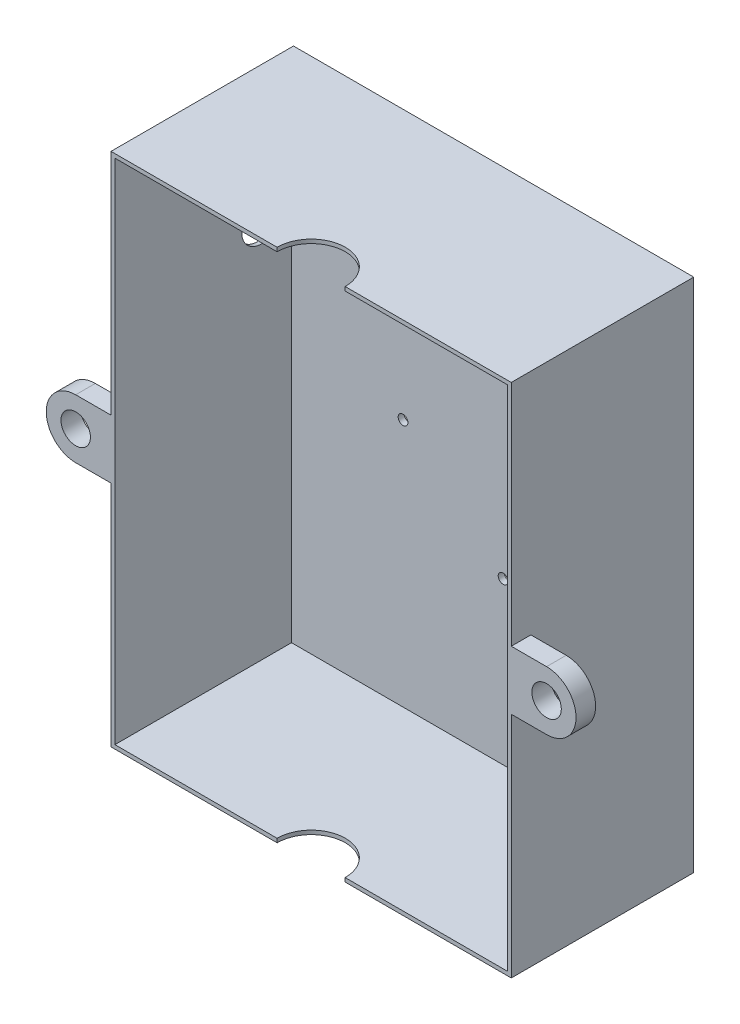
ISO-10303-21;
HEADER;
FILE_DESCRIPTION(('STEP AP214'),'2;1');
FILE_NAME('part.step','',(''),(''),'','','');
FILE_SCHEMA(('AUTOMOTIVE_DESIGN { 1 0 10303 214 1 1 1 1 }'));
ENDSEC;
DATA;
#1=APPLICATION_CONTEXT('core data for automotive mechanical design processes');
#2=APPLICATION_PROTOCOL_DEFINITION('international standard','automotive_design',2000,#1);
#3=PRODUCT_CONTEXT('',#1,'mechanical');
#4=PRODUCT('Part','Part','',(#3));
#5=PRODUCT_RELATED_PRODUCT_CATEGORY('part','',(#4));
#6=PRODUCT_DEFINITION_FORMATION('','',#4);
#7=PRODUCT_DEFINITION_CONTEXT('part definition',#1,'design');
#8=PRODUCT_DEFINITION('design','',#6,#7);
#9=PRODUCT_DEFINITION_SHAPE('','',#8);
#10=(LENGTH_UNIT() NAMED_UNIT(*) SI_UNIT(.MILLI.,.METRE.));
#11=(NAMED_UNIT(*) PLANE_ANGLE_UNIT() SI_UNIT($,.RADIAN.));
#12=(NAMED_UNIT(*) SI_UNIT($,.STERADIAN.) SOLID_ANGLE_UNIT());
#13=UNCERTAINTY_MEASURE_WITH_UNIT(LENGTH_MEASURE(1.E-05),#10,'distance_accuracy_value','');
#14=(GEOMETRIC_REPRESENTATION_CONTEXT(3) GLOBAL_UNCERTAINTY_ASSIGNED_CONTEXT((#13)) GLOBAL_UNIT_ASSIGNED_CONTEXT((#10,
#11,#12)) REPRESENTATION_CONTEXT('',''));
#15=CARTESIAN_POINT('',(0.,0.,0.));
#16=DIRECTION('',(0.,0.,1.));
#17=DIRECTION('',(1.,0.,0.));
#18=AXIS2_PLACEMENT_3D('',#15,#16,#17);
#19=CARTESIAN_POINT('',(0.,0.,93.));
#20=DIRECTION('',(0.,0.,1.));
#21=DIRECTION('',(1.,0.,0.));
#22=AXIS2_PLACEMENT_3D('',#19,#20,#21);
#23=PLANE('',#22);
#24=DIRECTION('',(0.,-1.,0.));
#25=VECTOR('',#24,1.);
#26=CARTESIAN_POINT('',(-15.6831277223151,124.735057131812,93.));
#27=LINE('',#26,#25);
#28=CARTESIAN_POINT('',(-15.6831277223151,124.735057131812,93.));
#29=VERTEX_POINT('',#28);
#30=CARTESIAN_POINT('',(-15.6831277223151,122.735057131812,93.));
#31=VERTEX_POINT('',#30);
#32=EDGE_CURVE('E13',#29,#31,#27,.T.);
#33=ORIENTED_EDGE('',*,*,#32,.F.);
#34=DIRECTION('',(-1.,0.,0.));
#35=VECTOR('',#34,1.);
#36=CARTESIAN_POINT('',(103.649083583159,124.735057131812,93.));
#37=LINE('',#36,#35);
#38=CARTESIAN_POINT('',(-100.350916416841,124.735057131812,93.));
#39=VERTEX_POINT('',#38);
#40=EDGE_CURVE('E306',#29,#39,#37,.T.);
#41=ORIENTED_EDGE('',*,*,#40,.T.);
#42=DIRECTION('',(0.,-1.,0.));
#43=VECTOR('',#42,1.);
#44=CARTESIAN_POINT('',(-100.350916416841,124.735057131812,93.));
#45=LINE('',#44,#43);
#46=CARTESIAN_POINT('',(-100.350916416841,8.29525975196561,93.));
#47=VERTEX_POINT('',#46);
#48=EDGE_CURVE('E295',#39,#47,#45,.T.);
#49=ORIENTED_EDGE('',*,*,#48,.T.);
#50=DIRECTION('',(-1.,0.,0.));
#51=VECTOR('',#50,1.);
#52=CARTESIAN_POINT('',(-118.350916416841,8.29525975196548,93.));
#53=LINE('',#52,#51);
#54=CARTESIAN_POINT('',(-118.350916416841,8.29525975196548,93.));
#55=VERTEX_POINT('',#54);
#56=EDGE_CURVE('E60',#47,#55,#53,.T.);
#57=ORIENTED_EDGE('',*,*,#56,.T.);
#58=CARTESIAN_POINT('',(-118.350916416841,-6.70474024803448,93.));
#59=DIRECTION('',(0.,0.,1.));
#60=DIRECTION('',(1.,0.,0.));
#61=AXIS2_PLACEMENT_3D('',#58,#59,#60);
#62=CIRCLE('',#61,15.);
#63=CARTESIAN_POINT('',(-118.350916416841,-21.7047402480344,93.));
#64=VERTEX_POINT('',#63);
#65=EDGE_CURVE('E199',#55,#64,#62,.T.);
#66=ORIENTED_EDGE('',*,*,#65,.T.);
#67=DIRECTION('',(1.,0.,0.));
#68=VECTOR('',#67,1.);
#69=CARTESIAN_POINT('',(-118.350916416841,-21.7047402480344,93.));
#70=LINE('',#69,#68);
#71=CARTESIAN_POINT('',(-100.350916416841,-21.7047402480343,93.));
#72=VERTEX_POINT('',#71);
#73=EDGE_CURVE('E372',#64,#72,#70,.T.);
#74=ORIENTED_EDGE('',*,*,#73,.T.);
#75=CARTESIAN_POINT('',(-100.350916416841,-138.14453762788,93.));
#76=VERTEX_POINT('',#75);
#77=EDGE_CURVE('E204',#72,#76,#45,.T.);
#78=ORIENTED_EDGE('',*,*,#77,.T.);
#79=DIRECTION('',(1.,0.,0.));
#80=VECTOR('',#79,1.);
#81=CARTESIAN_POINT('',(-100.350916416841,-138.14453762788,93.));
#82=LINE('',#81,#80);
#83=CARTESIAN_POINT('',(-15.6831277223151,-138.14453762788,93.));
#84=VERTEX_POINT('',#83);
#85=EDGE_CURVE('E299',#76,#84,#82,.T.);
#86=ORIENTED_EDGE('',*,*,#85,.T.);
#87=CARTESIAN_POINT('',(-15.6831277223151,-136.14453762788,93.));
#88=VERTEX_POINT('',#87);
#89=EDGE_CURVE('E49',#88,#84,#27,.T.);
#90=ORIENTED_EDGE('',*,*,#89,.F.);
#91=DIRECTION('',(1.,0.,0.));
#92=VECTOR('',#91,1.);
#93=CARTESIAN_POINT('',(-98.3509164168411,-136.14453762788,93.));
#94=LINE('',#93,#92);
#95=CARTESIAN_POINT('',(-98.3509164168411,-136.14453762788,93.));
#96=VERTEX_POINT('',#95);
#97=EDGE_CURVE('E289',#96,#88,#94,.T.);
#98=ORIENTED_EDGE('',*,*,#97,.F.);
#99=DIRECTION('',(0.,-1.,0.));
#100=VECTOR('',#99,1.);
#101=CARTESIAN_POINT('',(-98.3509164168411,122.735057131812,93.));
#102=LINE('',#101,#100);
#103=CARTESIAN_POINT('',(-98.3509164168411,122.735057131812,93.));
#104=VERTEX_POINT('',#103);
#105=EDGE_CURVE('E285',#104,#96,#102,.T.);
#106=ORIENTED_EDGE('',*,*,#105,.F.);
#107=DIRECTION('',(-1.,0.,0.));
#108=VECTOR('',#107,1.);
#109=CARTESIAN_POINT('',(101.649083583159,122.735057131812,93.));
#110=LINE('',#109,#108);
#111=EDGE_CURVE('E261',#31,#104,#110,.T.);
#112=ORIENTED_EDGE('',*,*,#111,.F.);
#113=EDGE_LOOP('',(#33,#41,#49,#57,#66,#74,#78,#86,#90,#98,#106,#112));
#114=FACE_BOUND('',#113,.T.);
#115=CARTESIAN_POINT('',(-118.350916416841,-6.70474024803448,93.));
#116=DIRECTION('',(0.,0.,1.));
#117=DIRECTION('',(1.,0.,0.));
#118=AXIS2_PLACEMENT_3D('',#115,#116,#117);
#119=CIRCLE('',#118,7.5);
#120=CARTESIAN_POINT('',(-110.850916416841,-6.70474024803448,93.));
#121=VERTEX_POINT('',#120);
#122=EDGE_CURVE('E422',#121,#121,#119,.T.);
#123=ORIENTED_EDGE('',*,*,#122,.F.);
#124=EDGE_LOOP('',(#123));
#125=FACE_BOUND('',#124,.T.);
#126=ADVANCED_FACE('F45',(#114,#125),#23,.T.);
#127=CARTESIAN_POINT('',(0.,0.,3.));
#128=DIRECTION('',(0.,0.,-1.));
#129=DIRECTION('',(-1.,0.,0.));
#130=AXIS2_PLACEMENT_3D('',#127,#128,#129);
#131=PLANE('',#130);
#132=CARTESIAN_POINT('',(-41.5144444892979,-9.33687059436405,3.));
#133=DIRECTION('',(0.,0.,-1.));
#134=DIRECTION('',(-1.,0.,0.));
#135=AXIS2_PLACEMENT_3D('',#132,#133,#134);
#136=CIRCLE('',#135,2.50000000000045);
#137=CARTESIAN_POINT('',(-44.0144444892983,-9.33687059436405,3.));
#138=VERTEX_POINT('',#137);
#139=EDGE_CURVE('E258',#138,#138,#136,.T.);
#140=ORIENTED_EDGE('',*,*,#139,.T.);
#141=EDGE_LOOP('',(#140));
#142=FACE_BOUND('',#141,.T.);
#143=CARTESIAN_POINT('',(9.48555551070217,35.263129405635,3.));
#144=DIRECTION('',(0.,0.,-1.));
#145=DIRECTION('',(-1.,0.,0.));
#146=AXIS2_PLACEMENT_3D('',#143,#144,#145);
#147=CIRCLE('',#146,2.50000000000605);
#148=CARTESIAN_POINT('',(6.98555551069612,35.263129405635,3.));
#149=VERTEX_POINT('',#148);
#150=EDGE_CURVE('E265',#149,#149,#147,.T.);
#151=ORIENTED_EDGE('',*,*,#150,.T.);
#152=EDGE_LOOP('',(#151));
#153=FACE_BOUND('',#152,.T.);
#154=CARTESIAN_POINT('',(9.48555551070217,-53.9368705943671,3.));
#155=DIRECTION('',(0.,0.,-1.));
#156=DIRECTION('',(-1.,0.,0.));
#157=AXIS2_PLACEMENT_3D('',#154,#155,#156);
#158=CIRCLE('',#157,2.5);
#159=CARTESIAN_POINT('',(6.98555551070217,-53.9368705943671,3.));
#160=VERTEX_POINT('',#159);
#161=EDGE_CURVE('E271',#160,#160,#158,.T.);
#162=ORIENTED_EDGE('',*,*,#161,.T.);
#163=EDGE_LOOP('',(#162));
#164=FACE_BOUND('',#163,.T.);
#165=CARTESIAN_POINT('',(46.9855555107033,-20.6368705943667,3.));
#166=DIRECTION('',(0.,0.,-1.));
#167=DIRECTION('',(-1.,0.,0.));
#168=AXIS2_PLACEMENT_3D('',#165,#166,#167);
#169=CIRCLE('',#168,2.49999999999833);
#170=CARTESIAN_POINT('',(44.485555510705,-20.6368705943667,3.));
#171=VERTEX_POINT('',#170);
#172=EDGE_CURVE('E277',#171,#171,#169,.T.);
#173=ORIENTED_EDGE('',*,*,#172,.T.);
#174=EDGE_LOOP('',(#173));
#175=FACE_BOUND('',#174,.T.);
#176=DIRECTION('',(0.,1.,0.));
#177=VECTOR('',#176,1.);
#178=CARTESIAN_POINT('',(101.649083583159,-136.14453762788,3.));
#179=LINE('',#178,#177);
#180=CARTESIAN_POINT('',(101.649083583159,-136.14453762788,3.));
#181=VERTEX_POINT('',#180);
#182=CARTESIAN_POINT('',(101.649083583159,122.735057131812,3.));
#183=VERTEX_POINT('',#182);
#184=EDGE_CURVE('E335',#181,#183,#179,.T.);
#185=ORIENTED_EDGE('',*,*,#184,.T.);
#186=DIRECTION('',(-1.,0.,0.));
#187=VECTOR('',#186,1.);
#188=CARTESIAN_POINT('',(-98.3509164168411,122.735057131812,3.));
#189=LINE('',#188,#187);
#190=CARTESIAN_POINT('',(-98.3509164168411,122.735057131812,3.));
#191=VERTEX_POINT('',#190);
#192=EDGE_CURVE('E345',#183,#191,#189,.T.);
#193=ORIENTED_EDGE('',*,*,#192,.T.);
#194=DIRECTION('',(0.,-1.,0.));
#195=VECTOR('',#194,1.);
#196=CARTESIAN_POINT('',(-98.3509164168411,-136.14453762788,3.));
#197=LINE('',#196,#195);
#198=CARTESIAN_POINT('',(-98.3509164168411,-136.14453762788,3.));
#199=VERTEX_POINT('',#198);
#200=EDGE_CURVE('E348',#191,#199,#197,.T.);
#201=ORIENTED_EDGE('',*,*,#200,.T.);
#202=DIRECTION('',(1.,0.,0.));
#203=VECTOR('',#202,1.);
#204=CARTESIAN_POINT('',(-98.3509164168411,-136.14453762788,3.));
#205=LINE('',#204,#203);
#206=EDGE_CURVE('E351',#199,#181,#205,.T.);
#207=ORIENTED_EDGE('',*,*,#206,.T.);
#208=EDGE_LOOP('',(#185,#193,#201,#207));
#209=FACE_BOUND('',#208,.T.);
#210=ADVANCED_FACE('F398',(#142,#153,#164,#175,#209),#131,.F.);
#211=CARTESIAN_POINT('',(101.649083583159,122.735057131812,0.));
#212=DIRECTION('',(0.,1.,0.));
#213=DIRECTION('',(-1.,0.,0.));
#214=AXIS2_PLACEMENT_3D('',#211,#212,#213);
#215=PLANE('',#214);
#216=CARTESIAN_POINT('',(101.649083583159,122.735057131812,93.));
#217=VERTEX_POINT('',#216);
#218=CARTESIAN_POINT('',(18.9812535175443,122.735057131812,93.));
#219=VERTEX_POINT('',#218);
#220=EDGE_CURVE('E282',#217,#219,#110,.T.);
#221=ORIENTED_EDGE('',*,*,#220,.T.);
#222=CARTESIAN_POINT('',(1.6490628976146,122.735057131812,92.9340912458591));
#223=DIRECTION('',(0.,1.,0.));
#224=DIRECTION('',(-1.,0.,0.));
#225=AXIS2_PLACEMENT_3D('',#222,#223,#224);
#226=CIRCLE('',#225,17.3323159343883);
#227=EDGE_CURVE('E250',#219,#31,#226,.T.);
#228=ORIENTED_EDGE('',*,*,#227,.T.);
#229=ORIENTED_EDGE('',*,*,#111,.T.);
#230=DIRECTION('',(0.,0.,1.));
#231=VECTOR('',#230,1.);
#232=CARTESIAN_POINT('',(-98.3509164168411,122.735057131812,0.));
#233=LINE('',#232,#231);
#234=EDGE_CURVE('E310',#191,#104,#233,.T.);
#235=ORIENTED_EDGE('',*,*,#234,.F.);
#236=ORIENTED_EDGE('',*,*,#192,.F.);
#237=DIRECTION('',(0.,0.,1.));
#238=VECTOR('',#237,1.);
#239=CARTESIAN_POINT('',(101.649083583159,122.735057131812,0.));
#240=LINE('',#239,#238);
#241=EDGE_CURVE('E311',#183,#217,#240,.T.);
#242=ORIENTED_EDGE('',*,*,#241,.T.);
#243=EDGE_LOOP('',(#221,#228,#229,#235,#236,#242));
#244=FACE_BOUND('',#243,.T.);
#245=ADVANCED_FACE('F406',(#244),#215,.F.);
#246=CARTESIAN_POINT('',(101.649083583159,-136.14453762788,0.));
#247=DIRECTION('',(1.,0.,0.));
#248=DIRECTION('',(0.,1.,0.));
#249=AXIS2_PLACEMENT_3D('',#246,#247,#248);
#250=PLANE('',#249);
#251=ORIENTED_EDGE('',*,*,#241,.F.);
#252=ORIENTED_EDGE('',*,*,#184,.F.);
#253=DIRECTION('',(0.,0.,1.));
#254=VECTOR('',#253,1.);
#255=CARTESIAN_POINT('',(101.649083583159,-136.14453762788,0.));
#256=LINE('',#255,#254);
#257=CARTESIAN_POINT('',(101.649083583159,-136.14453762788,93.));
#258=VERTEX_POINT('',#257);
#259=EDGE_CURVE('E314',#181,#258,#256,.T.);
#260=ORIENTED_EDGE('',*,*,#259,.T.);
#261=DIRECTION('',(0.,1.,0.));
#262=VECTOR('',#261,1.);
#263=CARTESIAN_POINT('',(101.649083583159,-136.14453762788,93.));
#264=LINE('',#263,#262);
#265=EDGE_CURVE('E292',#258,#217,#264,.T.);
#266=ORIENTED_EDGE('',*,*,#265,.T.);
#267=EDGE_LOOP('',(#251,#252,#260,#266));
#268=FACE_BOUND('',#267,.T.);
#269=ADVANCED_FACE('F396',(#268),#250,.F.);
#270=CARTESIAN_POINT('',(-98.3509164168411,-136.14453762788,0.));
#271=DIRECTION('',(0.,-1.,0.));
#272=DIRECTION('',(0.,0.,-1.));
#273=AXIS2_PLACEMENT_3D('',#270,#271,#272);
#274=PLANE('',#273);
#275=ORIENTED_EDGE('',*,*,#97,.T.);
#276=CARTESIAN_POINT('',(1.6490628976146,-136.14453762788,92.9340912458591));
#277=DIRECTION('',(0.,-1.,0.));
#278=DIRECTION('',(0.,0.,-1.));
#279=AXIS2_PLACEMENT_3D('',#276,#277,#278);
#280=CIRCLE('',#279,17.3323159343883);
#281=CARTESIAN_POINT('',(18.9812535175443,-136.14453762788,93.));
#282=VERTEX_POINT('',#281);
#283=EDGE_CURVE('E254',#88,#282,#280,.T.);
#284=ORIENTED_EDGE('',*,*,#283,.T.);
#285=EDGE_CURVE('E288',#282,#258,#94,.T.);
#286=ORIENTED_EDGE('',*,*,#285,.T.);
#287=ORIENTED_EDGE('',*,*,#259,.F.);
#288=ORIENTED_EDGE('',*,*,#206,.F.);
#289=DIRECTION('',(0.,0.,1.));
#290=VECTOR('',#289,1.);
#291=CARTESIAN_POINT('',(-98.3509164168411,-136.14453762788,0.));
#292=LINE('',#291,#290);
#293=EDGE_CURVE('E317',#199,#96,#292,.T.);
#294=ORIENTED_EDGE('',*,*,#293,.T.);
#295=EDGE_LOOP('',(#275,#284,#286,#287,#288,#294));
#296=FACE_BOUND('',#295,.T.);
#297=ADVANCED_FACE('F392',(#296),#274,.F.);
#298=CARTESIAN_POINT('',(-98.3509164168411,122.735057131812,0.));
#299=DIRECTION('',(-1.,0.,0.));
#300=DIRECTION('',(0.,0.,1.));
#301=AXIS2_PLACEMENT_3D('',#298,#299,#300);
#302=PLANE('',#301);
#303=CARTESIAN_POINT('',(-98.3509164168411,57.5422285629295,18.3648736332411));
#304=DIRECTION('',(-1.,0.,0.));
#305=DIRECTION('',(0.,0.,1.));
#306=AXIS2_PLACEMENT_3D('',#303,#304,#305);
#307=CIRCLE('',#306,10.0000000000014);
#308=CARTESIAN_POINT('',(-98.3509164168411,57.5422285629295,28.3648736332425));
#309=VERTEX_POINT('',#308);
#310=EDGE_CURVE('E425',#309,#309,#307,.F.);
#311=ORIENTED_EDGE('',*,*,#310,.F.);
#312=EDGE_LOOP('',(#311));
#313=FACE_BOUND('',#312,.T.);
#314=ORIENTED_EDGE('',*,*,#293,.F.);
#315=ORIENTED_EDGE('',*,*,#200,.F.);
#316=ORIENTED_EDGE('',*,*,#234,.T.);
#317=ORIENTED_EDGE('',*,*,#105,.T.);
#318=EDGE_LOOP('',(#314,#315,#316,#317));
#319=FACE_BOUND('',#318,.T.);
#320=ADVANCED_FACE('F401',(#313,#319),#302,.F.);
#321=CARTESIAN_POINT('',(103.649083583159,124.735057131812,0.));
#322=DIRECTION('',(0.,1.,0.));
#323=DIRECTION('',(-1.,0.,0.));
#324=AXIS2_PLACEMENT_3D('',#321,#322,#323);
#325=PLANE('',#324);
#326=CARTESIAN_POINT('',(1.6490628976146,124.735057131812,92.9340912458591));
#327=DIRECTION('',(0.,-1.,0.));
#328=DIRECTION('',(0.,0.,-1.));
#329=AXIS2_PLACEMENT_3D('',#326,#327,#328);
#330=CIRCLE('',#329,17.3323159343883);
#331=CARTESIAN_POINT('',(18.9812535175443,124.735057131812,93.));
#332=VERTEX_POINT('',#331);
#333=EDGE_CURVE('E247',#29,#332,#330,.T.);
#334=ORIENTED_EDGE('',*,*,#333,.T.);
#335=CARTESIAN_POINT('',(103.649083583159,124.735057131812,93.));
#336=VERTEX_POINT('',#335);
#337=EDGE_CURVE('E307',#336,#332,#37,.T.);
#338=ORIENTED_EDGE('',*,*,#337,.F.);
#339=DIRECTION('',(0.,0.,1.));
#340=VECTOR('',#339,1.);
#341=CARTESIAN_POINT('',(103.649083583159,124.735057131812,0.));
#342=LINE('',#341,#340);
#343=CARTESIAN_POINT('',(103.649083583159,124.735057131812,0.));
#344=VERTEX_POINT('',#343);
#345=EDGE_CURVE('E336',#344,#336,#342,.T.);
#346=ORIENTED_EDGE('',*,*,#345,.F.);
#347=DIRECTION('',(-1.,0.,0.));
#348=VECTOR('',#347,1.);
#349=CARTESIAN_POINT('',(103.649083583159,124.735057131812,0.));
#350=LINE('',#349,#348);
#351=CARTESIAN_POINT('',(-100.350916416841,124.735057131812,0.));
#352=VERTEX_POINT('',#351);
#353=EDGE_CURVE('E328',#344,#352,#350,.T.);
#354=ORIENTED_EDGE('',*,*,#353,.T.);
#355=DIRECTION('',(0.,0.,1.));
#356=VECTOR('',#355,1.);
#357=CARTESIAN_POINT('',(-100.350916416841,124.735057131812,0.));
#358=LINE('',#357,#356);
#359=EDGE_CURVE('E332',#352,#39,#358,.T.);
#360=ORIENTED_EDGE('',*,*,#359,.T.);
#361=ORIENTED_EDGE('',*,*,#40,.F.);
#362=EDGE_LOOP('',(#334,#338,#346,#354,#360,#361));
#363=FACE_BOUND('',#362,.T.);
#364=ADVANCED_FACE('F409',(#363),#325,.T.);
#365=CARTESIAN_POINT('',(103.649083583159,-138.14453762788,0.));
#366=DIRECTION('',(1.,0.,0.));
#367=DIRECTION('',(0.,0.,-1.));
#368=AXIS2_PLACEMENT_3D('',#365,#366,#367);
#369=PLANE('',#368);
#370=DIRECTION('',(0.,0.,1.));
#371=VECTOR('',#370,1.);
#372=CARTESIAN_POINT('',(103.649083583159,8.29525975196571,83.));
#373=LINE('',#372,#371);
#374=CARTESIAN_POINT('',(103.649083583159,8.29525975196571,83.));
#375=VERTEX_POINT('',#374);
#376=CARTESIAN_POINT('',(103.649083583159,8.29525975196571,93.));
#377=VERTEX_POINT('',#376);
#378=EDGE_CURVE('E239',#375,#377,#373,.T.);
#379=ORIENTED_EDGE('',*,*,#378,.F.);
#380=DIRECTION('',(0.,-1.,0.));
#381=VECTOR('',#380,1.);
#382=CARTESIAN_POINT('',(103.649083583159,-21.7047402480343,83.));
#383=LINE('',#382,#381);
#384=CARTESIAN_POINT('',(103.649083583159,-21.7047402480343,83.));
#385=VERTEX_POINT('',#384);
#386=EDGE_CURVE('E219',#375,#385,#383,.T.);
#387=ORIENTED_EDGE('',*,*,#386,.T.);
#388=DIRECTION('',(0.,0.,1.));
#389=VECTOR('',#388,1.);
#390=CARTESIAN_POINT('',(103.649083583159,-21.7047402480343,83.));
#391=LINE('',#390,#389);
#392=CARTESIAN_POINT('',(103.649083583159,-21.7047402480343,93.));
#393=VERTEX_POINT('',#392);
#394=EDGE_CURVE('E232',#385,#393,#391,.T.);
#395=ORIENTED_EDGE('',*,*,#394,.T.);
#396=DIRECTION('',(0.,1.,0.));
#397=VECTOR('',#396,1.);
#398=CARTESIAN_POINT('',(103.649083583159,-138.14453762788,93.));
#399=LINE('',#398,#397);
#400=CARTESIAN_POINT('',(103.649083583159,-138.14453762788,93.));
#401=VERTEX_POINT('',#400);
#402=EDGE_CURVE('E303',#401,#393,#399,.T.);
#403=ORIENTED_EDGE('',*,*,#402,.F.);
#404=DIRECTION('',(0.,0.,1.));
#405=VECTOR('',#404,1.);
#406=CARTESIAN_POINT('',(103.649083583159,-138.14453762788,0.));
#407=LINE('',#406,#405);
#408=CARTESIAN_POINT('',(103.649083583159,-138.14453762788,0.));
#409=VERTEX_POINT('',#408);
#410=EDGE_CURVE('E339',#409,#401,#407,.T.);
#411=ORIENTED_EDGE('',*,*,#410,.F.);
#412=DIRECTION('',(0.,1.,0.));
#413=VECTOR('',#412,1.);
#414=CARTESIAN_POINT('',(103.649083583159,-138.14453762788,0.));
#415=LINE('',#414,#413);
#416=EDGE_CURVE('E325',#409,#344,#415,.T.);
#417=ORIENTED_EDGE('',*,*,#416,.T.);
#418=ORIENTED_EDGE('',*,*,#345,.T.);
#419=EDGE_CURVE('E302',#377,#336,#399,.T.);
#420=ORIENTED_EDGE('',*,*,#419,.F.);
#421=EDGE_LOOP('',(#379,#387,#395,#403,#411,#417,#418,#420));
#422=FACE_BOUND('',#421,.T.);
#423=ADVANCED_FACE('F380',(#422),#369,.T.);
#424=CARTESIAN_POINT('',(-100.350916416841,-138.14453762788,0.));
#425=DIRECTION('',(0.,-1.,0.));
#426=DIRECTION('',(0.,0.,-1.));
#427=AXIS2_PLACEMENT_3D('',#424,#425,#426);
#428=PLANE('',#427);
#429=CARTESIAN_POINT('',(1.6490628976146,-138.14453762788,92.9340912458591));
#430=DIRECTION('',(0.,-1.,0.));
#431=DIRECTION('',(0.,0.,-1.));
#432=AXIS2_PLACEMENT_3D('',#429,#430,#431);
#433=CIRCLE('',#432,17.3323159343883);
#434=CARTESIAN_POINT('',(18.9812535175442,-138.14453762788,93.));
#435=VERTEX_POINT('',#434);
#436=EDGE_CURVE('E241',#84,#435,#433,.T.);
#437=ORIENTED_EDGE('',*,*,#436,.F.);
#438=ORIENTED_EDGE('',*,*,#85,.F.);
#439=DIRECTION('',(0.,0.,1.));
#440=VECTOR('',#439,1.);
#441=CARTESIAN_POINT('',(-100.350916416841,-138.14453762788,0.));
#442=LINE('',#441,#440);
#443=CARTESIAN_POINT('',(-100.350916416841,-138.14453762788,0.));
#444=VERTEX_POINT('',#443);
#445=EDGE_CURVE('E331',#444,#76,#442,.T.);
#446=ORIENTED_EDGE('',*,*,#445,.F.);
#447=DIRECTION('',(1.,0.,0.));
#448=VECTOR('',#447,1.);
#449=CARTESIAN_POINT('',(-100.350916416841,-138.14453762788,0.));
#450=LINE('',#449,#448);
#451=EDGE_CURVE('E322',#444,#409,#450,.T.);
#452=ORIENTED_EDGE('',*,*,#451,.T.);
#453=ORIENTED_EDGE('',*,*,#410,.T.);
#454=EDGE_CURVE('E298',#435,#401,#82,.T.);
#455=ORIENTED_EDGE('',*,*,#454,.F.);
#456=EDGE_LOOP('',(#437,#438,#446,#452,#453,#455));
#457=FACE_BOUND('',#456,.T.);
#458=ADVANCED_FACE('F367',(#457),#428,.T.);
#459=CARTESIAN_POINT('',(-100.350916416841,122.735057131812,0.));
#460=DIRECTION('',(-1.,0.,0.));
#461=DIRECTION('',(0.,-1.,0.));
#462=AXIS2_PLACEMENT_3D('',#459,#460,#461);
#463=PLANE('',#462);
#464=CARTESIAN_POINT('',(-100.350916416841,57.5422285629295,18.3648736332411));
#465=DIRECTION('',(-1.,0.,0.));
#466=DIRECTION('',(0.,0.,1.));
#467=AXIS2_PLACEMENT_3D('',#464,#465,#466);
#468=CIRCLE('',#467,10.0000000000014);
#469=CARTESIAN_POINT('',(-100.350916416841,57.5422285629295,28.3648736332425));
#470=VERTEX_POINT('',#469);
#471=EDGE_CURVE('E428',#470,#470,#468,.T.);
#472=ORIENTED_EDGE('',*,*,#471,.F.);
#473=EDGE_LOOP('',(#472));
#474=FACE_BOUND('',#473,.T.);
#475=DIRECTION('',(0.,0.,1.));
#476=VECTOR('',#475,1.);
#477=CARTESIAN_POINT('',(-100.350916416841,-21.7047402480343,83.));
#478=LINE('',#477,#476);
#479=CARTESIAN_POINT('',(-100.350916416841,-21.7047402480343,83.));
#480=VERTEX_POINT('',#479);
#481=EDGE_CURVE('E196',#480,#72,#478,.T.);
#482=ORIENTED_EDGE('',*,*,#481,.F.);
#483=DIRECTION('',(0.,1.,0.));
#484=VECTOR('',#483,1.);
#485=CARTESIAN_POINT('',(-100.350916416841,-21.7047402480343,83.));
#486=LINE('',#485,#484);
#487=CARTESIAN_POINT('',(-100.350916416841,8.29525975196561,83.));
#488=VERTEX_POINT('',#487);
#489=EDGE_CURVE('E182',#480,#488,#486,.T.);
#490=ORIENTED_EDGE('',*,*,#489,.T.);
#491=DIRECTION('',(0.,0.,1.));
#492=VECTOR('',#491,1.);
#493=CARTESIAN_POINT('',(-100.350916416841,8.29525975196561,83.));
#494=LINE('',#493,#492);
#495=EDGE_CURVE('E205',#488,#47,#494,.T.);
#496=ORIENTED_EDGE('',*,*,#495,.T.);
#497=ORIENTED_EDGE('',*,*,#48,.F.);
#498=ORIENTED_EDGE('',*,*,#359,.F.);
#499=DIRECTION('',(0.,-1.,0.));
#500=VECTOR('',#499,1.);
#501=CARTESIAN_POINT('',(-100.350916416841,124.735057131812,0.));
#502=LINE('',#501,#500);
#503=EDGE_CURVE('E313',#352,#444,#502,.T.);
#504=ORIENTED_EDGE('',*,*,#503,.T.);
#505=ORIENTED_EDGE('',*,*,#445,.T.);
#506=ORIENTED_EDGE('',*,*,#77,.F.);
#507=EDGE_LOOP('',(#482,#490,#496,#497,#498,#504,#505,#506));
#508=FACE_BOUND('',#507,.T.);
#509=ADVANCED_FACE('F202',(#474,#508),#463,.T.);
#510=DIRECTION('',(0.,-1.,0.));
#511=VECTOR('',#510,1.);
#512=CARTESIAN_POINT('',(18.9812535175443,124.735057131812,93.));
#513=LINE('',#512,#511);
#514=EDGE_CURVE('E354',#435,#282,#513,.F.);
#515=ORIENTED_EDGE('',*,*,#514,.F.);
#516=ORIENTED_EDGE('',*,*,#454,.T.);
#517=ORIENTED_EDGE('',*,*,#402,.T.);
#518=DIRECTION('',(1.,0.,0.));
#519=VECTOR('',#518,1.);
#520=CARTESIAN_POINT('',(121.649083583159,-21.7047402480343,93.));
#521=LINE('',#520,#519);
#522=CARTESIAN_POINT('',(121.649083583159,-21.7047402480343,93.));
#523=VERTEX_POINT('',#522);
#524=EDGE_CURVE('E68',#393,#523,#521,.T.);
#525=ORIENTED_EDGE('',*,*,#524,.T.);
#526=CARTESIAN_POINT('',(121.649083583159,-6.70474024803429,93.));
#527=DIRECTION('',(0.,0.,1.));
#528=DIRECTION('',(1.,0.,0.));
#529=AXIS2_PLACEMENT_3D('',#526,#527,#528);
#530=CIRCLE('',#529,15.);
#531=CARTESIAN_POINT('',(121.649083583159,8.29525975196571,93.));
#532=VERTEX_POINT('',#531);
#533=EDGE_CURVE('E234',#523,#532,#530,.T.);
#534=ORIENTED_EDGE('',*,*,#533,.T.);
#535=DIRECTION('',(-1.,0.,0.));
#536=VECTOR('',#535,1.);
#537=CARTESIAN_POINT('',(121.649083583159,8.29525975196571,93.));
#538=LINE('',#537,#536);
#539=EDGE_CURVE('E223',#532,#377,#538,.T.);
#540=ORIENTED_EDGE('',*,*,#539,.T.);
#541=ORIENTED_EDGE('',*,*,#419,.T.);
#542=ORIENTED_EDGE('',*,*,#337,.T.);
#543=EDGE_CURVE('E353',#219,#332,#513,.F.);
#544=ORIENTED_EDGE('',*,*,#543,.F.);
#545=ORIENTED_EDGE('',*,*,#220,.F.);
#546=ORIENTED_EDGE('',*,*,#265,.F.);
#547=ORIENTED_EDGE('',*,*,#285,.F.);
#548=EDGE_LOOP('',(#515,#516,#517,#525,#534,#540,#541,#542,#544,#545,#546,#547));
#549=FACE_BOUND('',#548,.T.);
#550=CARTESIAN_POINT('',(121.649083583159,-6.70474024803429,93.));
#551=DIRECTION('',(0.,0.,1.));
#552=DIRECTION('',(1.,0.,0.));
#553=AXIS2_PLACEMENT_3D('',#550,#551,#552);
#554=CIRCLE('',#553,7.50000000000001);
#555=CARTESIAN_POINT('',(129.149083583159,-6.70474024803429,93.));
#556=VERTEX_POINT('',#555);
#557=EDGE_CURVE('E216',#556,#556,#554,.T.);
#558=ORIENTED_EDGE('',*,*,#557,.F.);
#559=EDGE_LOOP('',(#558));
#560=FACE_BOUND('',#559,.T.);
#561=ADVANCED_FACE('F385',(#549,#560),#23,.T.);
#562=CARTESIAN_POINT('',(0.,0.,0.));
#563=DIRECTION('',(0.,0.,-1.));
#564=DIRECTION('',(-1.,0.,0.));
#565=AXIS2_PLACEMENT_3D('',#562,#563,#564);
#566=PLANE('',#565);
#567=CARTESIAN_POINT('',(-41.5144444892979,-9.33687059436405,0.));
#568=DIRECTION('',(0.,0.,-1.));
#569=DIRECTION('',(-1.,0.,0.));
#570=AXIS2_PLACEMENT_3D('',#567,#568,#569);
#571=CIRCLE('',#570,2.50000000000045);
#572=CARTESIAN_POINT('',(-44.0144444892983,-9.33687059436405,0.));
#573=VERTEX_POINT('',#572);
#574=EDGE_CURVE('E262',#573,#573,#571,.T.);
#575=ORIENTED_EDGE('',*,*,#574,.F.);
#576=EDGE_LOOP('',(#575));
#577=FACE_BOUND('',#576,.T.);
#578=CARTESIAN_POINT('',(9.48555551070217,35.263129405635,0.));
#579=DIRECTION('',(0.,0.,-1.));
#580=DIRECTION('',(-1.,0.,0.));
#581=AXIS2_PLACEMENT_3D('',#578,#579,#580);
#582=CIRCLE('',#581,2.50000000000605);
#583=CARTESIAN_POINT('',(6.98555551069612,35.263129405635,0.));
#584=VERTEX_POINT('',#583);
#585=EDGE_CURVE('E268',#584,#584,#582,.T.);
#586=ORIENTED_EDGE('',*,*,#585,.F.);
#587=EDGE_LOOP('',(#586));
#588=FACE_BOUND('',#587,.T.);
#589=CARTESIAN_POINT('',(9.48555551070217,-53.9368705943671,0.));
#590=DIRECTION('',(0.,0.,-1.));
#591=DIRECTION('',(-1.,0.,0.));
#592=AXIS2_PLACEMENT_3D('',#589,#590,#591);
#593=CIRCLE('',#592,2.5);
#594=CARTESIAN_POINT('',(6.98555551070217,-53.9368705943671,0.));
#595=VERTEX_POINT('',#594);
#596=EDGE_CURVE('E274',#595,#595,#593,.T.);
#597=ORIENTED_EDGE('',*,*,#596,.F.);
#598=EDGE_LOOP('',(#597));
#599=FACE_BOUND('',#598,.T.);
#600=CARTESIAN_POINT('',(46.9855555107033,-20.6368705943667,0.));
#601=DIRECTION('',(0.,0.,-1.));
#602=DIRECTION('',(-1.,0.,0.));
#603=AXIS2_PLACEMENT_3D('',#600,#601,#602);
#604=CIRCLE('',#603,2.49999999999833);
#605=CARTESIAN_POINT('',(44.485555510705,-20.6368705943667,0.));
#606=VERTEX_POINT('',#605);
#607=EDGE_CURVE('E257',#606,#606,#604,.T.);
#608=ORIENTED_EDGE('',*,*,#607,.F.);
#609=EDGE_LOOP('',(#608));
#610=FACE_BOUND('',#609,.T.);
#611=ORIENTED_EDGE('',*,*,#503,.F.);
#612=ORIENTED_EDGE('',*,*,#353,.F.);
#613=ORIENTED_EDGE('',*,*,#416,.F.);
#614=ORIENTED_EDGE('',*,*,#451,.F.);
#615=EDGE_LOOP('',(#611,#612,#613,#614));
#616=FACE_BOUND('',#615,.T.);
#617=ADVANCED_FACE('F47',(#577,#588,#599,#610,#616),#566,.T.);
#618=CARTESIAN_POINT('',(46.9855555107033,-20.6368705943667,3.));
#619=DIRECTION('',(0.,0.,-1.));
#620=DIRECTION('',(-1.,0.,0.));
#621=AXIS2_PLACEMENT_3D('',#618,#619,#620);
#622=CYLINDRICAL_SURFACE('',#621,2.49999999999833);
#623=ORIENTED_EDGE('',*,*,#172,.F.);
#624=EDGE_LOOP('',(#623));
#625=FACE_BOUND('',#624,.T.);
#626=ORIENTED_EDGE('',*,*,#607,.T.);
#627=EDGE_LOOP('',(#626));
#628=FACE_BOUND('',#627,.T.);
#629=ADVANCED_FACE('F458',(#625,#628),#622,.F.);
#630=CARTESIAN_POINT('',(9.48555551070217,-53.9368705943671,3.));
#631=DIRECTION('',(0.,0.,-1.));
#632=DIRECTION('',(-1.,0.,0.));
#633=AXIS2_PLACEMENT_3D('',#630,#631,#632);
#634=CYLINDRICAL_SURFACE('',#633,2.5);
#635=ORIENTED_EDGE('',*,*,#161,.F.);
#636=EDGE_LOOP('',(#635));
#637=FACE_BOUND('',#636,.T.);
#638=ORIENTED_EDGE('',*,*,#596,.T.);
#639=EDGE_LOOP('',(#638));
#640=FACE_BOUND('',#639,.T.);
#641=ADVANCED_FACE('F648',(#637,#640),#634,.F.);
#642=CARTESIAN_POINT('',(9.48555551070217,35.263129405635,3.));
#643=DIRECTION('',(0.,0.,-1.));
#644=DIRECTION('',(-1.,0.,0.));
#645=AXIS2_PLACEMENT_3D('',#642,#643,#644);
#646=CYLINDRICAL_SURFACE('',#645,2.50000000000605);
#647=ORIENTED_EDGE('',*,*,#150,.F.);
#648=EDGE_LOOP('',(#647));
#649=FACE_BOUND('',#648,.T.);
#650=ORIENTED_EDGE('',*,*,#585,.T.);
#651=EDGE_LOOP('',(#650));
#652=FACE_BOUND('',#651,.T.);
#653=ADVANCED_FACE('F644',(#649,#652),#646,.F.);
#654=CARTESIAN_POINT('',(-41.5144444892979,-9.33687059436405,3.));
#655=DIRECTION('',(0.,0.,-1.));
#656=DIRECTION('',(-1.,0.,0.));
#657=AXIS2_PLACEMENT_3D('',#654,#655,#656);
#658=CYLINDRICAL_SURFACE('',#657,2.50000000000045);
#659=ORIENTED_EDGE('',*,*,#139,.F.);
#660=EDGE_LOOP('',(#659));
#661=FACE_BOUND('',#660,.T.);
#662=ORIENTED_EDGE('',*,*,#574,.T.);
#663=EDGE_LOOP('',(#662));
#664=FACE_BOUND('',#663,.T.);
#665=ADVANCED_FACE('F507',(#661,#664),#658,.F.);
#666=CARTESIAN_POINT('',(1.6490628976146,124.735057131812,92.9340912458591));
#667=DIRECTION('',(0.,-1.,0.));
#668=DIRECTION('',(0.,0.,-1.));
#669=AXIS2_PLACEMENT_3D('',#666,#667,#668);
#670=CYLINDRICAL_SURFACE('',#669,17.3323159343883);
#671=ORIENTED_EDGE('',*,*,#32,.T.);
#672=ORIENTED_EDGE('',*,*,#227,.F.);
#673=ORIENTED_EDGE('',*,*,#543,.T.);
#674=ORIENTED_EDGE('',*,*,#333,.F.);
#675=EDGE_LOOP('',(#671,#672,#673,#674));
#676=FACE_BOUND('',#675,.T.);
#677=ADVANCED_FACE('F407',(#676),#670,.F.);
#678=ORIENTED_EDGE('',*,*,#89,.T.);
#679=ORIENTED_EDGE('',*,*,#436,.T.);
#680=ORIENTED_EDGE('',*,*,#514,.T.);
#681=ORIENTED_EDGE('',*,*,#283,.F.);
#682=EDGE_LOOP('',(#678,#679,#680,#681));
#683=FACE_BOUND('',#682,.T.);
#684=ADVANCED_FACE('F361',(#683),#670,.F.);
#685=CARTESIAN_POINT('',(121.649083583159,8.29525975196571,83.));
#686=DIRECTION('',(0.,1.,0.));
#687=DIRECTION('',(-1.,0.,0.));
#688=AXIS2_PLACEMENT_3D('',#685,#686,#687);
#689=PLANE('',#688);
#690=ORIENTED_EDGE('',*,*,#539,.F.);
#691=DIRECTION('',(0.,0.,1.));
#692=VECTOR('',#691,1.);
#693=CARTESIAN_POINT('',(121.649083583159,8.29525975196571,83.));
#694=LINE('',#693,#692);
#695=CARTESIAN_POINT('',(121.649083583159,8.29525975196571,83.));
#696=VERTEX_POINT('',#695);
#697=EDGE_CURVE('E242',#696,#532,#694,.T.);
#698=ORIENTED_EDGE('',*,*,#697,.F.);
#699=DIRECTION('',(-1.,0.,0.));
#700=VECTOR('',#699,1.);
#701=CARTESIAN_POINT('',(121.649083583159,8.29525975196571,83.));
#702=LINE('',#701,#700);
#703=EDGE_CURVE('E229',#696,#375,#702,.T.);
#704=ORIENTED_EDGE('',*,*,#703,.T.);
#705=ORIENTED_EDGE('',*,*,#378,.T.);
#706=EDGE_LOOP('',(#690,#698,#704,#705));
#707=FACE_BOUND('',#706,.T.);
#708=ADVANCED_FACE('F517',(#707),#689,.T.);
#709=CARTESIAN_POINT('',(121.649083583159,-6.70474024803429,83.));
#710=DIRECTION('',(0.,0.,1.));
#711=DIRECTION('',(1.,0.,0.));
#712=AXIS2_PLACEMENT_3D('',#709,#710,#711);
#713=CYLINDRICAL_SURFACE('',#712,15.);
#714=ORIENTED_EDGE('',*,*,#533,.F.);
#715=DIRECTION('',(0.,0.,1.));
#716=VECTOR('',#715,1.);
#717=CARTESIAN_POINT('',(121.649083583159,-21.7047402480343,83.));
#718=LINE('',#717,#716);
#719=CARTESIAN_POINT('',(121.649083583159,-21.7047402480343,83.));
#720=VERTEX_POINT('',#719);
#721=EDGE_CURVE('E244',#720,#523,#718,.T.);
#722=ORIENTED_EDGE('',*,*,#721,.F.);
#723=CARTESIAN_POINT('',(121.649083583159,-6.70474024803429,83.));
#724=DIRECTION('',(0.,0.,1.));
#725=DIRECTION('',(1.,0.,0.));
#726=AXIS2_PLACEMENT_3D('',#723,#724,#725);
#727=CIRCLE('',#726,15.);
#728=EDGE_CURVE('E226',#720,#696,#727,.T.);
#729=ORIENTED_EDGE('',*,*,#728,.T.);
#730=ORIENTED_EDGE('',*,*,#697,.T.);
#731=EDGE_LOOP('',(#714,#722,#729,#730));
#732=FACE_BOUND('',#731,.T.);
#733=ADVANCED_FACE('F540',(#732),#713,.T.);
#734=CARTESIAN_POINT('',(121.649083583159,-21.7047402480343,83.));
#735=DIRECTION('',(0.,-1.,0.));
#736=DIRECTION('',(0.,0.,-1.));
#737=AXIS2_PLACEMENT_3D('',#734,#735,#736);
#738=PLANE('',#737);
#739=ORIENTED_EDGE('',*,*,#524,.F.);
#740=ORIENTED_EDGE('',*,*,#394,.F.);
#741=DIRECTION('',(1.,0.,0.));
#742=VECTOR('',#741,1.);
#743=CARTESIAN_POINT('',(121.649083583159,-21.7047402480343,83.));
#744=LINE('',#743,#742);
#745=EDGE_CURVE('E222',#385,#720,#744,.T.);
#746=ORIENTED_EDGE('',*,*,#745,.T.);
#747=ORIENTED_EDGE('',*,*,#721,.T.);
#748=EDGE_LOOP('',(#739,#740,#746,#747));
#749=FACE_BOUND('',#748,.T.);
#750=ADVANCED_FACE('F550',(#749),#738,.T.);
#751=CARTESIAN_POINT('',(121.649083583159,-6.70474024803429,83.));
#752=DIRECTION('',(0.,0.,1.));
#753=DIRECTION('',(1.,0.,0.));
#754=AXIS2_PLACEMENT_3D('',#751,#752,#753);
#755=PLANE('',#754);
#756=CARTESIAN_POINT('',(121.649083583159,-6.70474024803429,83.));
#757=DIRECTION('',(0.,0.,1.));
#758=DIRECTION('',(1.,0.,0.));
#759=AXIS2_PLACEMENT_3D('',#756,#757,#758);
#760=CIRCLE('',#759,7.50000000000001);
#761=CARTESIAN_POINT('',(129.149083583159,-6.70474024803429,83.));
#762=VERTEX_POINT('',#761);
#763=EDGE_CURVE('E213',#762,#762,#760,.T.);
#764=ORIENTED_EDGE('',*,*,#763,.T.);
#765=EDGE_LOOP('',(#764));
#766=FACE_BOUND('',#765,.T.);
#767=ORIENTED_EDGE('',*,*,#386,.F.);
#768=ORIENTED_EDGE('',*,*,#703,.F.);
#769=ORIENTED_EDGE('',*,*,#728,.F.);
#770=ORIENTED_EDGE('',*,*,#745,.F.);
#771=EDGE_LOOP('',(#767,#768,#769,#770));
#772=FACE_BOUND('',#771,.T.);
#773=ADVANCED_FACE('F560',(#766,#772),#755,.F.);
#774=CARTESIAN_POINT('',(121.649083583159,-6.70474024803429,83.));
#775=DIRECTION('',(0.,0.,1.));
#776=DIRECTION('',(1.,0.,0.));
#777=AXIS2_PLACEMENT_3D('',#774,#775,#776);
#778=CYLINDRICAL_SURFACE('',#777,7.50000000000001);
#779=ORIENTED_EDGE('',*,*,#763,.F.);
#780=EDGE_LOOP('',(#779));
#781=FACE_BOUND('',#780,.T.);
#782=ORIENTED_EDGE('',*,*,#557,.T.);
#783=EDGE_LOOP('',(#782));
#784=FACE_BOUND('',#783,.T.);
#785=ADVANCED_FACE('F569',(#781,#784),#778,.F.);
#786=CARTESIAN_POINT('',(-118.350916416841,-21.7047402480344,83.));
#787=DIRECTION('',(0.,-1.,0.));
#788=DIRECTION('',(1.,0.,0.));
#789=AXIS2_PLACEMENT_3D('',#786,#787,#788);
#790=PLANE('',#789);
#791=ORIENTED_EDGE('',*,*,#73,.F.);
#792=DIRECTION('',(0.,0.,1.));
#793=VECTOR('',#792,1.);
#794=CARTESIAN_POINT('',(-118.350916416841,-21.7047402480344,83.));
#795=LINE('',#794,#793);
#796=CARTESIAN_POINT('',(-118.350916416841,-21.7047402480344,83.));
#797=VERTEX_POINT('',#796);
#798=EDGE_CURVE('E198',#797,#64,#795,.T.);
#799=ORIENTED_EDGE('',*,*,#798,.F.);
#800=DIRECTION('',(1.,0.,0.));
#801=VECTOR('',#800,1.);
#802=CARTESIAN_POINT('',(-118.350916416841,-21.7047402480344,83.));
#803=LINE('',#802,#801);
#804=EDGE_CURVE('E186',#797,#480,#803,.T.);
#805=ORIENTED_EDGE('',*,*,#804,.T.);
#806=ORIENTED_EDGE('',*,*,#481,.T.);
#807=EDGE_LOOP('',(#791,#799,#805,#806));
#808=FACE_BOUND('',#807,.T.);
#809=ADVANCED_FACE('F195',(#808),#790,.T.);
#810=CARTESIAN_POINT('',(-118.350916416841,-6.70474024803448,83.));
#811=DIRECTION('',(0.,0.,1.));
#812=DIRECTION('',(1.,0.,0.));
#813=AXIS2_PLACEMENT_3D('',#810,#811,#812);
#814=CYLINDRICAL_SURFACE('',#813,15.);
#815=ORIENTED_EDGE('',*,*,#65,.F.);
#816=DIRECTION('',(0.,0.,1.));
#817=VECTOR('',#816,1.);
#818=CARTESIAN_POINT('',(-118.350916416841,8.29525975196548,83.));
#819=LINE('',#818,#817);
#820=CARTESIAN_POINT('',(-118.350916416841,8.29525975196548,83.));
#821=VERTEX_POINT('',#820);
#822=EDGE_CURVE('E208',#821,#55,#819,.T.);
#823=ORIENTED_EDGE('',*,*,#822,.F.);
#824=CARTESIAN_POINT('',(-118.350916416841,-6.70474024803448,83.));
#825=DIRECTION('',(0.,0.,1.));
#826=DIRECTION('',(1.,0.,0.));
#827=AXIS2_PLACEMENT_3D('',#824,#825,#826);
#828=CIRCLE('',#827,15.);
#829=EDGE_CURVE('E206',#821,#797,#828,.T.);
#830=ORIENTED_EDGE('',*,*,#829,.T.);
#831=ORIENTED_EDGE('',*,*,#798,.T.);
#832=EDGE_LOOP('',(#815,#823,#830,#831));
#833=FACE_BOUND('',#832,.T.);
#834=ADVANCED_FACE('F415',(#833),#814,.T.);
#835=CARTESIAN_POINT('',(-118.350916416841,8.29525975196548,83.));
#836=DIRECTION('',(0.,1.,0.));
#837=DIRECTION('',(-1.,0.,0.));
#838=AXIS2_PLACEMENT_3D('',#835,#836,#837);
#839=PLANE('',#838);
#840=ORIENTED_EDGE('',*,*,#56,.F.);
#841=ORIENTED_EDGE('',*,*,#495,.F.);
#842=DIRECTION('',(-1.,0.,0.));
#843=VECTOR('',#842,1.);
#844=CARTESIAN_POINT('',(-118.350916416841,8.29525975196548,83.));
#845=LINE('',#844,#843);
#846=EDGE_CURVE('E189',#488,#821,#845,.T.);
#847=ORIENTED_EDGE('',*,*,#846,.T.);
#848=ORIENTED_EDGE('',*,*,#822,.T.);
#849=EDGE_LOOP('',(#840,#841,#847,#848));
#850=FACE_BOUND('',#849,.T.);
#851=ADVANCED_FACE('F412',(#850),#839,.T.);
#852=CARTESIAN_POINT('',(-118.350916416841,-6.70474024803448,83.));
#853=DIRECTION('',(0.,0.,1.));
#854=DIRECTION('',(1.,0.,0.));
#855=AXIS2_PLACEMENT_3D('',#852,#853,#854);
#856=PLANE('',#855);
#857=CARTESIAN_POINT('',(-118.350916416841,-6.70474024803448,83.));
#858=DIRECTION('',(0.,0.,1.));
#859=DIRECTION('',(1.,0.,0.));
#860=AXIS2_PLACEMENT_3D('',#857,#858,#859);
#861=CIRCLE('',#860,7.5);
#862=CARTESIAN_POINT('',(-110.850916416841,-6.70474024803448,83.));
#863=VERTEX_POINT('',#862);
#864=EDGE_CURVE('E420',#863,#863,#861,.T.);
#865=ORIENTED_EDGE('',*,*,#864,.T.);
#866=EDGE_LOOP('',(#865));
#867=FACE_BOUND('',#866,.T.);
#868=ORIENTED_EDGE('',*,*,#804,.F.);
#869=ORIENTED_EDGE('',*,*,#829,.F.);
#870=ORIENTED_EDGE('',*,*,#846,.F.);
#871=ORIENTED_EDGE('',*,*,#489,.F.);
#872=EDGE_LOOP('',(#868,#869,#870,#871));
#873=FACE_BOUND('',#872,.T.);
#874=ADVANCED_FACE('F184',(#867,#873),#856,.F.);
#875=CARTESIAN_POINT('',(-118.350916416841,-6.70474024803448,83.));
#876=DIRECTION('',(0.,0.,1.));
#877=DIRECTION('',(1.,0.,0.));
#878=AXIS2_PLACEMENT_3D('',#875,#876,#877);
#879=CYLINDRICAL_SURFACE('',#878,7.5);
#880=ORIENTED_EDGE('',*,*,#864,.F.);
#881=EDGE_LOOP('',(#880));
#882=FACE_BOUND('',#881,.T.);
#883=ORIENTED_EDGE('',*,*,#122,.T.);
#884=EDGE_LOOP('',(#883));
#885=FACE_BOUND('',#884,.T.);
#886=ADVANCED_FACE('F612',(#882,#885),#879,.F.);
#887=CARTESIAN_POINT('',(136.650083583159,57.5422285629295,18.3648736332411));
#888=DIRECTION('',(-1.,0.,0.));
#889=DIRECTION('',(0.,0.,1.));
#890=AXIS2_PLACEMENT_3D('',#887,#888,#889);
#891=CYLINDRICAL_SURFACE('',#890,10.0000000000014);
#892=ORIENTED_EDGE('',*,*,#471,.T.);
#893=EDGE_LOOP('',(#892));
#894=FACE_BOUND('',#893,.T.);
#895=ORIENTED_EDGE('',*,*,#310,.T.);
#896=EDGE_LOOP('',(#895));
#897=FACE_BOUND('',#896,.T.);
#898=ADVANCED_FACE('F434',(#894,#897),#891,.F.);
#899=CLOSED_SHELL('',(#126,#210,#245,#269,#297,#320,#364,#423,#458,#509,#561,#617,#629,#641,
#653,#665,#677,#684,#708,#733,#750,#773,#785,#809,#834,#851,#874,#886,#898));
#900=MANIFOLD_SOLID_BREP('B2',#899);
#901=ADVANCED_BREP_SHAPE_REPRESENTATION('',(#18,#900),#14);
#902=SHAPE_DEFINITION_REPRESENTATION(#9,#901);
ENDSEC;
END-ISO-10303-21;
